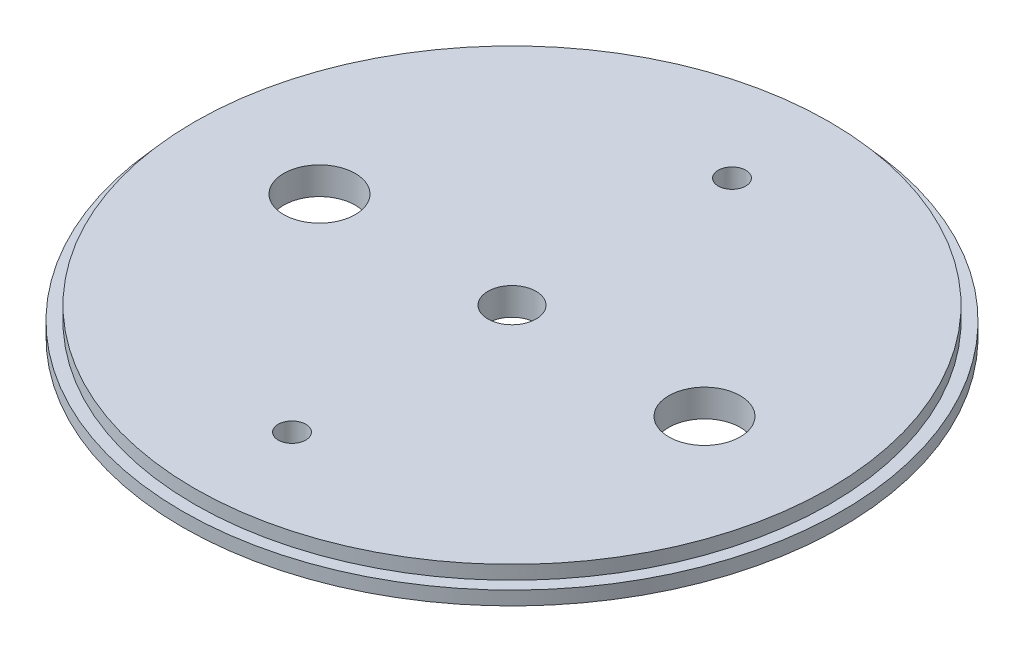
ISO-10303-21;
HEADER;
FILE_DESCRIPTION(('STEP AP214'),'2;1');
FILE_NAME('part.step','',(''),(''),'','','');
FILE_SCHEMA(('AUTOMOTIVE_DESIGN { 1 0 10303 214 1 1 1 1 }'));
ENDSEC;
DATA;
#1=APPLICATION_CONTEXT('core data for automotive mechanical design processes');
#2=APPLICATION_PROTOCOL_DEFINITION('international standard','automotive_design',2000,#1);
#3=PRODUCT_CONTEXT('',#1,'mechanical');
#4=PRODUCT('Part','Part','',(#3));
#5=PRODUCT_RELATED_PRODUCT_CATEGORY('part','',(#4));
#6=PRODUCT_DEFINITION_FORMATION('','',#4);
#7=PRODUCT_DEFINITION_CONTEXT('part definition',#1,'design');
#8=PRODUCT_DEFINITION('design','',#6,#7);
#9=PRODUCT_DEFINITION_SHAPE('','',#8);
#10=(LENGTH_UNIT() NAMED_UNIT(*) SI_UNIT(.MILLI.,.METRE.));
#11=(NAMED_UNIT(*) PLANE_ANGLE_UNIT() SI_UNIT($,.RADIAN.));
#12=(NAMED_UNIT(*) SI_UNIT($,.STERADIAN.) SOLID_ANGLE_UNIT());
#13=UNCERTAINTY_MEASURE_WITH_UNIT(LENGTH_MEASURE(1.E-05),#10,'distance_accuracy_value','');
#14=(GEOMETRIC_REPRESENTATION_CONTEXT(3) GLOBAL_UNCERTAINTY_ASSIGNED_CONTEXT((#13)) GLOBAL_UNIT_ASSIGNED_CONTEXT((#10,
#11,#12)) REPRESENTATION_CONTEXT('',''));
#15=CARTESIAN_POINT('',(0.,0.,0.));
#16=DIRECTION('',(0.,0.,1.));
#17=DIRECTION('',(1.,0.,0.));
#18=AXIS2_PLACEMENT_3D('',#15,#16,#17);
#19=CARTESIAN_POINT('',(0.,3.175,0.));
#20=DIRECTION('',(0.,-1.,0.));
#21=DIRECTION('',(0.,0.,-1.));
#22=AXIS2_PLACEMENT_3D('',#19,#20,#21);
#23=CYLINDRICAL_SURFACE('',#22,76.0984);
#24=CARTESIAN_POINT('',(0.,3.175,0.));
#25=DIRECTION('',(0.,1.,0.));
#26=DIRECTION('',(0.,0.,1.));
#27=AXIS2_PLACEMENT_3D('',#24,#25,#26);
#28=CIRCLE('',#27,76.0984);
#29=CARTESIAN_POINT('',(0.,3.175,76.0984));
#30=VERTEX_POINT('',#29);
#31=EDGE_CURVE('E10',#30,#30,#28,.T.);
#32=ORIENTED_EDGE('',*,*,#31,.F.);
#33=EDGE_LOOP('',(#32));
#34=FACE_BOUND('',#33,.T.);
#35=CARTESIAN_POINT('',(0.,0.,0.));
#36=DIRECTION('',(0.,1.,0.));
#37=DIRECTION('',(0.,0.,1.));
#38=AXIS2_PLACEMENT_3D('',#35,#36,#37);
#39=CIRCLE('',#38,76.0984);
#40=CARTESIAN_POINT('',(0.,0.,76.0984));
#41=VERTEX_POINT('',#40);
#42=EDGE_CURVE('E46',#41,#41,#39,.T.);
#43=ORIENTED_EDGE('',*,*,#42,.T.);
#44=EDGE_LOOP('',(#43));
#45=FACE_BOUND('',#44,.T.);
#46=ADVANCED_FACE('F43',(#34,#45),#23,.T.);
#47=CARTESIAN_POINT('',(0.,3.175,0.));
#48=DIRECTION('',(0.,1.,0.));
#49=DIRECTION('',(0.,0.,1.));
#50=AXIS2_PLACEMENT_3D('',#47,#48,#49);
#51=PLANE('',#50);
#52=CARTESIAN_POINT('',(0.,3.175,0.));
#53=DIRECTION('',(0.,1.,0.));
#54=DIRECTION('',(0.,0.,1.));
#55=AXIS2_PLACEMENT_3D('',#52,#53,#54);
#56=CIRCLE('',#55,73.3171);
#57=CARTESIAN_POINT('',(0.,3.175,73.3171));
#58=VERTEX_POINT('',#57);
#59=EDGE_CURVE('E53',#58,#58,#56,.F.);
#60=ORIENTED_EDGE('',*,*,#59,.T.);
#61=EDGE_LOOP('',(#60));
#62=FACE_BOUND('',#61,.T.);
#63=ORIENTED_EDGE('',*,*,#31,.T.);
#64=EDGE_LOOP('',(#63));
#65=FACE_BOUND('',#64,.T.);
#66=ADVANCED_FACE('F105',(#62,#65),#51,.T.);
#67=CARTESIAN_POINT('',(0.,0.,0.));
#68=DIRECTION('',(0.,1.,0.));
#69=DIRECTION('',(0.,0.,1.));
#70=AXIS2_PLACEMENT_3D('',#67,#68,#69);
#71=PLANE('',#70);
#72=CARTESIAN_POINT('',(0.,0.,0.));
#73=DIRECTION('',(0.,-1.,0.));
#74=DIRECTION('',(0.,0.,-1.));
#75=AXIS2_PLACEMENT_3D('',#72,#73,#74);
#76=CIRCLE('',#75,5.55625);
#77=CARTESIAN_POINT('',(0.,0.,-5.55625));
#78=VERTEX_POINT('',#77);
#79=EDGE_CURVE('E85',#78,#78,#76,.T.);
#80=ORIENTED_EDGE('',*,*,#79,.F.);
#81=EDGE_LOOP('',(#80));
#82=FACE_BOUND('',#81,.T.);
#83=CARTESIAN_POINT('',(-44.45,0.,0.));
#84=DIRECTION('',(0.,-1.,0.));
#85=DIRECTION('',(0.,0.,-1.));
#86=AXIS2_PLACEMENT_3D('',#83,#84,#85);
#87=CIRCLE('',#86,8.25);
#88=CARTESIAN_POINT('',(-44.45,0.,-8.25000000000001));
#89=VERTEX_POINT('',#88);
#90=EDGE_CURVE('E81',#89,#89,#87,.T.);
#91=ORIENTED_EDGE('',*,*,#90,.F.);
#92=EDGE_LOOP('',(#91));
#93=FACE_BOUND('',#92,.T.);
#94=CARTESIAN_POINT('',(44.45,0.,0.));
#95=DIRECTION('',(0.,-1.,0.));
#96=DIRECTION('',(0.,0.,-1.));
#97=AXIS2_PLACEMENT_3D('',#94,#95,#96);
#98=CIRCLE('',#97,8.25);
#99=CARTESIAN_POINT('',(44.45,0.,-8.25000000000001));
#100=VERTEX_POINT('',#99);
#101=EDGE_CURVE('E75',#100,#100,#98,.T.);
#102=ORIENTED_EDGE('',*,*,#101,.F.);
#103=EDGE_LOOP('',(#102));
#104=FACE_BOUND('',#103,.T.);
#105=CARTESIAN_POINT('',(0.,0.,-50.8));
#106=DIRECTION('',(0.,-1.,0.));
#107=DIRECTION('',(0.,0.,-1.));
#108=AXIS2_PLACEMENT_3D('',#105,#106,#107);
#109=CIRCLE('',#108,3.175);
#110=CARTESIAN_POINT('',(0.,0.,-53.975));
#111=VERTEX_POINT('',#110);
#112=EDGE_CURVE('E69',#111,#111,#109,.T.);
#113=ORIENTED_EDGE('',*,*,#112,.F.);
#114=EDGE_LOOP('',(#113));
#115=FACE_BOUND('',#114,.T.);
#116=CARTESIAN_POINT('',(0.,0.,50.8));
#117=DIRECTION('',(0.,-1.,0.));
#118=DIRECTION('',(0.,0.,-1.));
#119=AXIS2_PLACEMENT_3D('',#116,#117,#118);
#120=CIRCLE('',#119,3.175);
#121=CARTESIAN_POINT('',(0.,0.,47.625));
#122=VERTEX_POINT('',#121);
#123=EDGE_CURVE('E63',#122,#122,#120,.T.);
#124=ORIENTED_EDGE('',*,*,#123,.F.);
#125=EDGE_LOOP('',(#124));
#126=FACE_BOUND('',#125,.T.);
#127=ORIENTED_EDGE('',*,*,#42,.F.);
#128=EDGE_LOOP('',(#127));
#129=FACE_BOUND('',#128,.T.);
#130=ADVANCED_FACE('F101',(#82,#93,#104,#115,#126,#129),#71,.F.);
#131=CARTESIAN_POINT('',(0.,6.35,0.));
#132=DIRECTION('',(0.,-1.,0.));
#133=DIRECTION('',(0.,0.,-1.));
#134=AXIS2_PLACEMENT_3D('',#131,#132,#133);
#135=CYLINDRICAL_SURFACE('',#134,73.3171);
#136=ORIENTED_EDGE('',*,*,#59,.F.);
#137=EDGE_LOOP('',(#136));
#138=FACE_BOUND('',#137,.T.);
#139=CARTESIAN_POINT('',(0.,6.35,0.));
#140=DIRECTION('',(0.,1.,0.));
#141=DIRECTION('',(0.,0.,1.));
#142=AXIS2_PLACEMENT_3D('',#139,#140,#141);
#143=CIRCLE('',#142,73.3171);
#144=CARTESIAN_POINT('',(0.,6.35,73.3171));
#145=VERTEX_POINT('',#144);
#146=EDGE_CURVE('E57',#145,#145,#143,.T.);
#147=ORIENTED_EDGE('',*,*,#146,.F.);
#148=EDGE_LOOP('',(#147));
#149=FACE_BOUND('',#148,.T.);
#150=ADVANCED_FACE('F104',(#138,#149),#135,.T.);
#151=CARTESIAN_POINT('',(0.,6.35,0.));
#152=DIRECTION('',(0.,1.,0.));
#153=DIRECTION('',(0.,0.,1.));
#154=AXIS2_PLACEMENT_3D('',#151,#152,#153);
#155=PLANE('',#154);
#156=CARTESIAN_POINT('',(0.,6.35,0.));
#157=DIRECTION('',(0.,-1.,0.));
#158=DIRECTION('',(0.,0.,-1.));
#159=AXIS2_PLACEMENT_3D('',#156,#157,#158);
#160=CIRCLE('',#159,5.55625);
#161=CARTESIAN_POINT('',(0.,6.35,-5.55625));
#162=VERTEX_POINT('',#161);
#163=EDGE_CURVE('E84',#162,#162,#160,.T.);
#164=ORIENTED_EDGE('',*,*,#163,.T.);
#165=EDGE_LOOP('',(#164));
#166=FACE_BOUND('',#165,.T.);
#167=CARTESIAN_POINT('',(-44.45,6.35,0.));
#168=DIRECTION('',(0.,-1.,0.));
#169=DIRECTION('',(0.,0.,-1.));
#170=AXIS2_PLACEMENT_3D('',#167,#168,#169);
#171=CIRCLE('',#170,8.25);
#172=CARTESIAN_POINT('',(-44.45,6.35,-8.25000000000001));
#173=VERTEX_POINT('',#172);
#174=EDGE_CURVE('E78',#173,#173,#171,.T.);
#175=ORIENTED_EDGE('',*,*,#174,.T.);
#176=EDGE_LOOP('',(#175));
#177=FACE_BOUND('',#176,.T.);
#178=CARTESIAN_POINT('',(44.45,6.35,0.));
#179=DIRECTION('',(0.,-1.,0.));
#180=DIRECTION('',(0.,0.,-1.));
#181=AXIS2_PLACEMENT_3D('',#178,#179,#180);
#182=CIRCLE('',#181,8.25);
#183=CARTESIAN_POINT('',(44.45,6.35,-8.25000000000001));
#184=VERTEX_POINT('',#183);
#185=EDGE_CURVE('E72',#184,#184,#182,.T.);
#186=ORIENTED_EDGE('',*,*,#185,.T.);
#187=EDGE_LOOP('',(#186));
#188=FACE_BOUND('',#187,.T.);
#189=CARTESIAN_POINT('',(0.,6.35,-50.8));
#190=DIRECTION('',(0.,-1.,0.));
#191=DIRECTION('',(0.,0.,-1.));
#192=AXIS2_PLACEMENT_3D('',#189,#190,#191);
#193=CIRCLE('',#192,3.175);
#194=CARTESIAN_POINT('',(0.,6.35,-53.975));
#195=VERTEX_POINT('',#194);
#196=EDGE_CURVE('E66',#195,#195,#193,.T.);
#197=ORIENTED_EDGE('',*,*,#196,.T.);
#198=EDGE_LOOP('',(#197));
#199=FACE_BOUND('',#198,.T.);
#200=CARTESIAN_POINT('',(0.,6.35,50.8));
#201=DIRECTION('',(0.,-1.,0.));
#202=DIRECTION('',(0.,0.,-1.));
#203=AXIS2_PLACEMENT_3D('',#200,#201,#202);
#204=CIRCLE('',#203,3.175);
#205=CARTESIAN_POINT('',(0.,6.35,47.625));
#206=VERTEX_POINT('',#205);
#207=EDGE_CURVE('E60',#206,#206,#204,.T.);
#208=ORIENTED_EDGE('',*,*,#207,.T.);
#209=EDGE_LOOP('',(#208));
#210=FACE_BOUND('',#209,.T.);
#211=ORIENTED_EDGE('',*,*,#146,.T.);
#212=EDGE_LOOP('',(#211));
#213=FACE_BOUND('',#212,.T.);
#214=ADVANCED_FACE('F91',(#166,#177,#188,#199,#210,#213),#155,.T.);
#215=CARTESIAN_POINT('',(0.,0.,50.8));
#216=DIRECTION('',(0.,-1.,0.));
#217=DIRECTION('',(0.,0.,-1.));
#218=AXIS2_PLACEMENT_3D('',#215,#216,#217);
#219=CYLINDRICAL_SURFACE('',#218,3.175);
#220=ORIENTED_EDGE('',*,*,#207,.F.);
#221=EDGE_LOOP('',(#220));
#222=FACE_BOUND('',#221,.T.);
#223=ORIENTED_EDGE('',*,*,#123,.T.);
#224=EDGE_LOOP('',(#223));
#225=FACE_BOUND('',#224,.T.);
#226=ADVANCED_FACE('F131',(#222,#225),#219,.F.);
#227=CARTESIAN_POINT('',(0.,0.,-50.8));
#228=DIRECTION('',(0.,-1.,0.));
#229=DIRECTION('',(0.,0.,-1.));
#230=AXIS2_PLACEMENT_3D('',#227,#228,#229);
#231=CYLINDRICAL_SURFACE('',#230,3.175);
#232=ORIENTED_EDGE('',*,*,#196,.F.);
#233=EDGE_LOOP('',(#232));
#234=FACE_BOUND('',#233,.T.);
#235=ORIENTED_EDGE('',*,*,#112,.T.);
#236=EDGE_LOOP('',(#235));
#237=FACE_BOUND('',#236,.T.);
#238=ADVANCED_FACE('F134',(#234,#237),#231,.F.);
#239=CARTESIAN_POINT('',(44.45,0.,0.));
#240=DIRECTION('',(0.,-1.,0.));
#241=DIRECTION('',(0.,0.,-1.));
#242=AXIS2_PLACEMENT_3D('',#239,#240,#241);
#243=CYLINDRICAL_SURFACE('',#242,8.25);
#244=ORIENTED_EDGE('',*,*,#185,.F.);
#245=EDGE_LOOP('',(#244));
#246=FACE_BOUND('',#245,.T.);
#247=ORIENTED_EDGE('',*,*,#101,.T.);
#248=EDGE_LOOP('',(#247));
#249=FACE_BOUND('',#248,.T.);
#250=ADVANCED_FACE('F138',(#246,#249),#243,.F.);
#251=CARTESIAN_POINT('',(-44.45,0.,0.));
#252=DIRECTION('',(0.,-1.,0.));
#253=DIRECTION('',(0.,0.,-1.));
#254=AXIS2_PLACEMENT_3D('',#251,#252,#253);
#255=CYLINDRICAL_SURFACE('',#254,8.25);
#256=ORIENTED_EDGE('',*,*,#174,.F.);
#257=EDGE_LOOP('',(#256));
#258=FACE_BOUND('',#257,.T.);
#259=ORIENTED_EDGE('',*,*,#90,.T.);
#260=EDGE_LOOP('',(#259));
#261=FACE_BOUND('',#260,.T.);
#262=ADVANCED_FACE('F97',(#258,#261),#255,.F.);
#263=CARTESIAN_POINT('',(0.,6.35,0.));
#264=DIRECTION('',(0.,-1.,0.));
#265=DIRECTION('',(0.,0.,-1.));
#266=AXIS2_PLACEMENT_3D('',#263,#264,#265);
#267=CYLINDRICAL_SURFACE('',#266,5.55625);
#268=ORIENTED_EDGE('',*,*,#163,.F.);
#269=EDGE_LOOP('',(#268));
#270=FACE_BOUND('',#269,.T.);
#271=ORIENTED_EDGE('',*,*,#79,.T.);
#272=EDGE_LOOP('',(#271));
#273=FACE_BOUND('',#272,.T.);
#274=ADVANCED_FACE('F94',(#270,#273),#267,.F.);
#275=CLOSED_SHELL('',(#46,#66,#130,#150,#214,#226,#238,#250,#262,#274));
#276=MANIFOLD_SOLID_BREP('B2',#275);
#277=ADVANCED_BREP_SHAPE_REPRESENTATION('',(#18,#276),#14);
#278=SHAPE_DEFINITION_REPRESENTATION(#9,#277);
ENDSEC;
END-ISO-10303-21;
